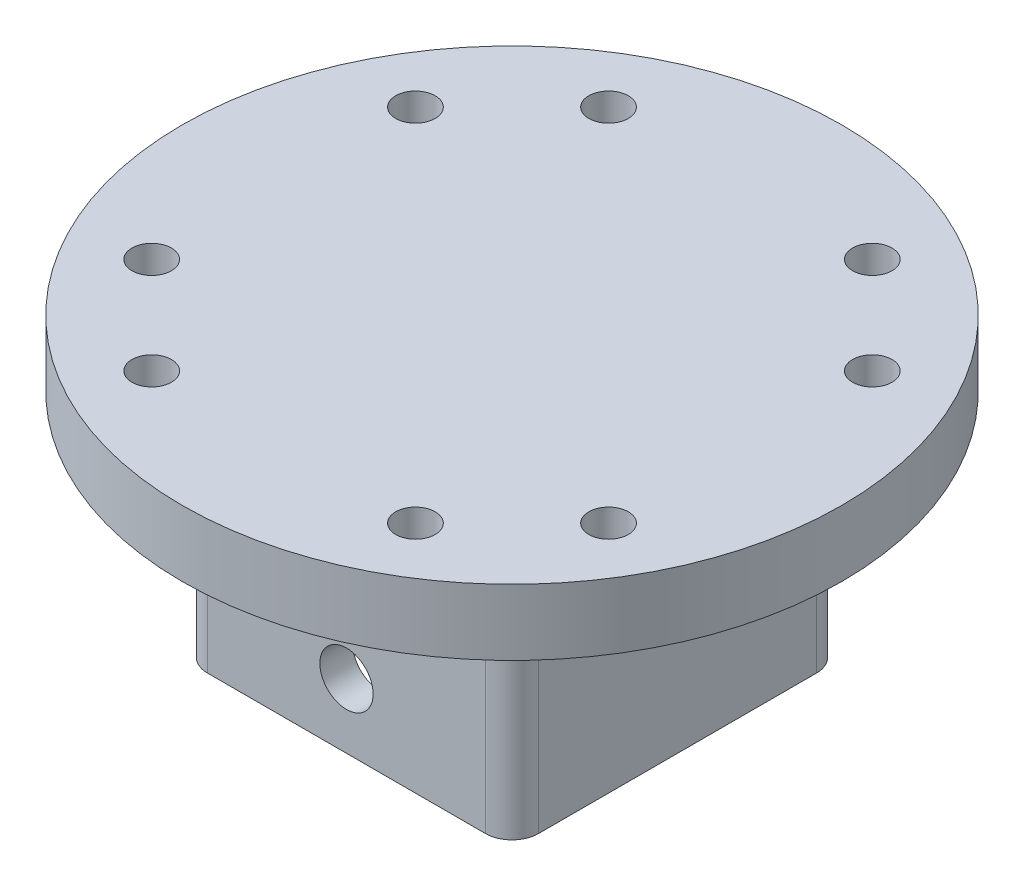
ISO-10303-21;
HEADER;
FILE_DESCRIPTION(('STEP AP214'),'2;1');
FILE_NAME('part.step','',(''),(''),'','','');
FILE_SCHEMA(('AUTOMOTIVE_DESIGN { 1 0 10303 214 1 1 1 1 }'));
ENDSEC;
DATA;
#1=APPLICATION_CONTEXT('core data for automotive mechanical design processes');
#2=APPLICATION_PROTOCOL_DEFINITION('international standard','automotive_design',2000,#1);
#3=PRODUCT_CONTEXT('',#1,'mechanical');
#4=PRODUCT('Part','Part','',(#3));
#5=PRODUCT_RELATED_PRODUCT_CATEGORY('part','',(#4));
#6=PRODUCT_DEFINITION_FORMATION('','',#4);
#7=PRODUCT_DEFINITION_CONTEXT('part definition',#1,'design');
#8=PRODUCT_DEFINITION('design','',#6,#7);
#9=PRODUCT_DEFINITION_SHAPE('','',#8);
#10=(LENGTH_UNIT() NAMED_UNIT(*) SI_UNIT(.MILLI.,.METRE.));
#11=(NAMED_UNIT(*) PLANE_ANGLE_UNIT() SI_UNIT($,.RADIAN.));
#12=(NAMED_UNIT(*) SI_UNIT($,.STERADIAN.) SOLID_ANGLE_UNIT());
#13=UNCERTAINTY_MEASURE_WITH_UNIT(LENGTH_MEASURE(1.E-05),#10,'distance_accuracy_value','');
#14=(GEOMETRIC_REPRESENTATION_CONTEXT(3) GLOBAL_UNCERTAINTY_ASSIGNED_CONTEXT((#13)) GLOBAL_UNIT_ASSIGNED_CONTEXT((#10,
#11,#12)) REPRESENTATION_CONTEXT('',''));
#15=CARTESIAN_POINT('',(0.,0.,0.));
#16=DIRECTION('',(0.,0.,1.));
#17=DIRECTION('',(1.,0.,0.));
#18=AXIS2_PLACEMENT_3D('',#15,#16,#17);
#19=CARTESIAN_POINT('',(0.,6.35,0.));
#20=DIRECTION('',(0.,-1.,0.));
#21=DIRECTION('',(0.,0.,-1.));
#22=AXIS2_PLACEMENT_3D('',#19,#20,#21);
#23=CYLINDRICAL_SURFACE('',#22,31.75);
#24=CARTESIAN_POINT('',(0.,6.35,0.));
#25=DIRECTION('',(0.,1.,0.));
#26=DIRECTION('',(0.,0.,1.));
#27=AXIS2_PLACEMENT_3D('',#24,#25,#26);
#28=CIRCLE('',#27,31.75);
#29=CARTESIAN_POINT('',(0.,6.35,31.75));
#30=VERTEX_POINT('',#29);
#31=EDGE_CURVE('E216',#30,#30,#28,.T.);
#32=ORIENTED_EDGE('',*,*,#31,.F.);
#33=EDGE_LOOP('',(#32));
#34=FACE_BOUND('',#33,.T.);
#35=CARTESIAN_POINT('',(0.,0.,0.));
#36=DIRECTION('',(0.,1.,0.));
#37=DIRECTION('',(0.,0.,1.));
#38=AXIS2_PLACEMENT_3D('',#35,#36,#37);
#39=CIRCLE('',#38,31.75);
#40=CARTESIAN_POINT('',(0.,0.,31.75));
#41=VERTEX_POINT('',#40);
#42=EDGE_CURVE('E215',#41,#41,#39,.T.);
#43=ORIENTED_EDGE('',*,*,#42,.T.);
#44=EDGE_LOOP('',(#43));
#45=FACE_BOUND('',#44,.T.);
#46=ADVANCED_FACE('F41',(#34,#45),#23,.T.);
#47=CARTESIAN_POINT('',(0.,6.35,0.));
#48=DIRECTION('',(0.,1.,0.));
#49=DIRECTION('',(0.,0.,1.));
#50=AXIS2_PLACEMENT_3D('',#47,#48,#49);
#51=PLANE('',#50);
#52=CARTESIAN_POINT('',(12.7000000000003,6.35,-21.9970452561246));
#53=DIRECTION('',(0.,1.,0.));
#54=DIRECTION('',(-1.,0.,0.));
#55=AXIS2_PLACEMENT_3D('',#52,#53,#54);
#56=CIRCLE('',#55,1.90000001);
#57=CARTESIAN_POINT('',(10.7999999900003,6.35,-21.9970452561246));
#58=VERTEX_POINT('',#57);
#59=EDGE_CURVE('E309',#58,#58,#56,.T.);
#60=ORIENTED_EDGE('',*,*,#59,.F.);
#61=EDGE_LOOP('',(#60));
#62=FACE_BOUND('',#61,.T.);
#63=CARTESIAN_POINT('',(-12.6999999999998,6.35,-21.9970452561249));
#64=DIRECTION('',(0.,1.,0.));
#65=DIRECTION('',(1.,0.,0.));
#66=AXIS2_PLACEMENT_3D('',#63,#64,#65);
#67=CIRCLE('',#66,1.90000001);
#68=CARTESIAN_POINT('',(-10.7999999899998,6.35,-21.9970452561248));
#69=VERTEX_POINT('',#68);
#70=EDGE_CURVE('E538',#69,#69,#67,.T.);
#71=ORIENTED_EDGE('',*,*,#70,.F.);
#72=EDGE_LOOP('',(#71));
#73=FACE_BOUND('',#72,.T.);
#74=CARTESIAN_POINT('',(-21.9970452561247,6.35,-12.7));
#75=DIRECTION('',(0.,1.,0.));
#76=DIRECTION('',(0.,0.,1.));
#77=AXIS2_PLACEMENT_3D('',#74,#75,#76);
#78=CIRCLE('',#77,1.90000001);
#79=CARTESIAN_POINT('',(-21.9970452561247,6.35,-10.79999999));
#80=VERTEX_POINT('',#79);
#81=EDGE_CURVE('E532',#80,#80,#78,.T.);
#82=ORIENTED_EDGE('',*,*,#81,.F.);
#83=EDGE_LOOP('',(#82));
#84=FACE_BOUND('',#83,.T.);
#85=CARTESIAN_POINT('',(-21.9970452561247,6.35,12.7));
#86=DIRECTION('',(0.,1.,0.));
#87=DIRECTION('',(0.,0.,-1.));
#88=AXIS2_PLACEMENT_3D('',#85,#86,#87);
#89=CIRCLE('',#88,1.90000001);
#90=CARTESIAN_POINT('',(-21.9970452561247,6.35,10.79999999));
#91=VERTEX_POINT('',#90);
#92=EDGE_CURVE('E523',#91,#91,#89,.T.);
#93=ORIENTED_EDGE('',*,*,#92,.F.);
#94=EDGE_LOOP('',(#93));
#95=FACE_BOUND('',#94,.T.);
#96=CARTESIAN_POINT('',(-12.7000000000001,6.35,21.9970452561247));
#97=DIRECTION('',(0.,1.,0.));
#98=DIRECTION('',(1.,0.,0.));
#99=AXIS2_PLACEMENT_3D('',#96,#97,#98);
#100=CIRCLE('',#99,1.90000001);
#101=CARTESIAN_POINT('',(-10.7999999900001,6.35,21.9970452561247));
#102=VERTEX_POINT('',#101);
#103=EDGE_CURVE('E323',#102,#102,#100,.T.);
#104=ORIENTED_EDGE('',*,*,#103,.F.);
#105=EDGE_LOOP('',(#104));
#106=FACE_BOUND('',#105,.T.);
#107=CARTESIAN_POINT('',(12.7,6.35,21.9970452561248));
#108=DIRECTION('',(0.,1.,0.));
#109=DIRECTION('',(-1.,0.,0.));
#110=AXIS2_PLACEMENT_3D('',#107,#108,#109);
#111=CIRCLE('',#110,1.90000001);
#112=CARTESIAN_POINT('',(10.79999999,6.35,21.9970452561248));
#113=VERTEX_POINT('',#112);
#114=EDGE_CURVE('E226',#113,#113,#111,.T.);
#115=ORIENTED_EDGE('',*,*,#114,.F.);
#116=EDGE_LOOP('',(#115));
#117=FACE_BOUND('',#116,.T.);
#118=CARTESIAN_POINT('',(21.9970452561247,6.35,-12.7));
#119=DIRECTION('',(0.,1.,0.));
#120=DIRECTION('',(0.,0.,1.));
#121=AXIS2_PLACEMENT_3D('',#118,#119,#120);
#122=CIRCLE('',#121,1.90000001);
#123=CARTESIAN_POINT('',(21.9970452561247,6.35,-10.79999999));
#124=VERTEX_POINT('',#123);
#125=EDGE_CURVE('E194',#124,#124,#122,.T.);
#126=ORIENTED_EDGE('',*,*,#125,.F.);
#127=EDGE_LOOP('',(#126));
#128=FACE_BOUND('',#127,.T.);
#129=CARTESIAN_POINT('',(21.9970452561247,6.35,12.7));
#130=DIRECTION('',(0.,1.,0.));
#131=DIRECTION('',(0.,0.,-1.));
#132=AXIS2_PLACEMENT_3D('',#129,#130,#131);
#133=CIRCLE('',#132,1.90000001);
#134=CARTESIAN_POINT('',(21.9970452561247,6.35,10.79999999));
#135=VERTEX_POINT('',#134);
#136=EDGE_CURVE('E187',#135,#135,#133,.T.);
#137=ORIENTED_EDGE('',*,*,#136,.F.);
#138=EDGE_LOOP('',(#137));
#139=FACE_BOUND('',#138,.T.);
#140=ORIENTED_EDGE('',*,*,#31,.T.);
#141=EDGE_LOOP('',(#140));
#142=FACE_BOUND('',#141,.T.);
#143=ADVANCED_FACE('F346',(#62,#73,#84,#95,#106,#117,#128,#139,#142),#51,.T.);
#144=CARTESIAN_POINT('',(0.,0.,0.));
#145=DIRECTION('',(0.,1.,0.));
#146=DIRECTION('',(0.,0.,1.));
#147=AXIS2_PLACEMENT_3D('',#144,#145,#146);
#148=PLANE('',#147);
#149=DIRECTION('',(0.,0.,-1.));
#150=VECTOR('',#149,1.);
#151=CARTESIAN_POINT('',(18.4785,0.,0.));
#152=LINE('',#151,#150);
#153=CARTESIAN_POINT('',(18.4785,0.,13.3985));
#154=VERTEX_POINT('',#153);
#155=CARTESIAN_POINT('',(18.4785,0.,-13.3985));
#156=VERTEX_POINT('',#155);
#157=EDGE_CURVE('E264',#154,#156,#152,.T.);
#158=ORIENTED_EDGE('',*,*,#157,.T.);
#159=CARTESIAN_POINT('',(13.3985,0.,-13.3985));
#160=DIRECTION('',(0.,1.,0.));
#161=DIRECTION('',(0.,0.,1.));
#162=AXIS2_PLACEMENT_3D('',#159,#160,#161);
#163=CIRCLE('',#162,5.08);
#164=CARTESIAN_POINT('',(13.3985,0.,-18.4785));
#165=VERTEX_POINT('',#164);
#166=EDGE_CURVE('E266',#156,#165,#163,.T.);
#167=ORIENTED_EDGE('',*,*,#166,.T.);
#168=DIRECTION('',(-1.,0.,0.));
#169=VECTOR('',#168,1.);
#170=CARTESIAN_POINT('',(0.,0.,-18.4785));
#171=LINE('',#170,#169);
#172=CARTESIAN_POINT('',(-13.3985,0.,-18.4785));
#173=VERTEX_POINT('',#172);
#174=EDGE_CURVE('E252',#165,#173,#171,.T.);
#175=ORIENTED_EDGE('',*,*,#174,.T.);
#176=CARTESIAN_POINT('',(-13.3985,0.,-13.3985));
#177=DIRECTION('',(0.,1.,0.));
#178=DIRECTION('',(0.,0.,1.));
#179=AXIS2_PLACEMENT_3D('',#176,#177,#178);
#180=CIRCLE('',#179,5.08);
#181=CARTESIAN_POINT('',(-18.4785,0.,-13.3985));
#182=VERTEX_POINT('',#181);
#183=EDGE_CURVE('E254',#173,#182,#180,.T.);
#184=ORIENTED_EDGE('',*,*,#183,.T.);
#185=DIRECTION('',(0.,0.,1.));
#186=VECTOR('',#185,1.);
#187=CARTESIAN_POINT('',(-18.4785,0.,0.));
#188=LINE('',#187,#186);
#189=CARTESIAN_POINT('',(-18.4785,0.,13.3985));
#190=VERTEX_POINT('',#189);
#191=EDGE_CURVE('E256',#182,#190,#188,.T.);
#192=ORIENTED_EDGE('',*,*,#191,.T.);
#193=CARTESIAN_POINT('',(-13.3985,0.,13.3985));
#194=DIRECTION('',(0.,1.,0.));
#195=DIRECTION('',(0.,0.,1.));
#196=AXIS2_PLACEMENT_3D('',#193,#194,#195);
#197=CIRCLE('',#196,5.08);
#198=CARTESIAN_POINT('',(-13.3985,0.,18.4785));
#199=VERTEX_POINT('',#198);
#200=EDGE_CURVE('E258',#190,#199,#197,.T.);
#201=ORIENTED_EDGE('',*,*,#200,.T.);
#202=DIRECTION('',(1.,0.,0.));
#203=VECTOR('',#202,1.);
#204=CARTESIAN_POINT('',(0.,0.,18.4785));
#205=LINE('',#204,#203);
#206=CARTESIAN_POINT('',(13.3985,0.,18.4785));
#207=VERTEX_POINT('',#206);
#208=EDGE_CURVE('E260',#199,#207,#205,.T.);
#209=ORIENTED_EDGE('',*,*,#208,.T.);
#210=CARTESIAN_POINT('',(13.3985,0.,13.3985));
#211=DIRECTION('',(0.,1.,0.));
#212=DIRECTION('',(0.,0.,1.));
#213=AXIS2_PLACEMENT_3D('',#210,#211,#212);
#214=CIRCLE('',#213,5.08);
#215=EDGE_CURVE('E262',#207,#154,#214,.T.);
#216=ORIENTED_EDGE('',*,*,#215,.T.);
#217=EDGE_LOOP('',(#158,#167,#175,#184,#192,#201,#209,#216));
#218=FACE_BOUND('',#217,.T.);
#219=CARTESIAN_POINT('',(12.7000000000003,0.,-21.9970452561246));
#220=DIRECTION('',(0.,1.,0.));
#221=DIRECTION('',(-1.,0.,0.));
#222=AXIS2_PLACEMENT_3D('',#219,#220,#221);
#223=CIRCLE('',#222,1.90000001);
#224=CARTESIAN_POINT('',(10.7999999900003,0.,-21.9970452561246));
#225=VERTEX_POINT('',#224);
#226=EDGE_CURVE('E303',#225,#225,#223,.T.);
#227=ORIENTED_EDGE('',*,*,#226,.T.);
#228=EDGE_LOOP('',(#227));
#229=FACE_BOUND('',#228,.T.);
#230=CARTESIAN_POINT('',(-12.6999999999998,0.,-21.9970452561249));
#231=DIRECTION('',(0.,1.,0.));
#232=DIRECTION('',(1.,0.,0.));
#233=AXIS2_PLACEMENT_3D('',#230,#231,#232);
#234=CIRCLE('',#233,1.90000001);
#235=CARTESIAN_POINT('',(-10.7999999899998,0.,-21.9970452561248));
#236=VERTEX_POINT('',#235);
#237=EDGE_CURVE('E314',#236,#236,#234,.T.);
#238=ORIENTED_EDGE('',*,*,#237,.T.);
#239=EDGE_LOOP('',(#238));
#240=FACE_BOUND('',#239,.T.);
#241=CARTESIAN_POINT('',(-21.9970452561247,0.,-12.7));
#242=DIRECTION('',(0.,1.,0.));
#243=DIRECTION('',(0.,0.,1.));
#244=AXIS2_PLACEMENT_3D('',#241,#242,#243);
#245=CIRCLE('',#244,1.90000001);
#246=CARTESIAN_POINT('',(-21.9970452561247,0.,-10.79999999));
#247=VERTEX_POINT('',#246);
#248=EDGE_CURVE('E535',#247,#247,#245,.T.);
#249=ORIENTED_EDGE('',*,*,#248,.T.);
#250=EDGE_LOOP('',(#249));
#251=FACE_BOUND('',#250,.T.);
#252=CARTESIAN_POINT('',(-21.9970452561247,0.,12.7));
#253=DIRECTION('',(0.,1.,0.));
#254=DIRECTION('',(0.,0.,-1.));
#255=AXIS2_PLACEMENT_3D('',#252,#253,#254);
#256=CIRCLE('',#255,1.90000001);
#257=CARTESIAN_POINT('',(-21.9970452561247,0.,10.79999999));
#258=VERTEX_POINT('',#257);
#259=EDGE_CURVE('E527',#258,#258,#256,.T.);
#260=ORIENTED_EDGE('',*,*,#259,.T.);
#261=EDGE_LOOP('',(#260));
#262=FACE_BOUND('',#261,.T.);
#263=CARTESIAN_POINT('',(-12.7000000000001,0.,21.9970452561247));
#264=DIRECTION('',(0.,1.,0.));
#265=DIRECTION('',(1.,0.,0.));
#266=AXIS2_PLACEMENT_3D('',#263,#264,#265);
#267=CIRCLE('',#266,1.90000001);
#268=CARTESIAN_POINT('',(-10.7999999900001,0.,21.9970452561247));
#269=VERTEX_POINT('',#268);
#270=EDGE_CURVE('E521',#269,#269,#267,.T.);
#271=ORIENTED_EDGE('',*,*,#270,.T.);
#272=EDGE_LOOP('',(#271));
#273=FACE_BOUND('',#272,.T.);
#274=CARTESIAN_POINT('',(12.7,0.,21.9970452561248));
#275=DIRECTION('',(0.,1.,0.));
#276=DIRECTION('',(-1.,0.,0.));
#277=AXIS2_PLACEMENT_3D('',#274,#275,#276);
#278=CIRCLE('',#277,1.90000001);
#279=CARTESIAN_POINT('',(10.79999999,0.,21.9970452561248));
#280=VERTEX_POINT('',#279);
#281=EDGE_CURVE('E320',#280,#280,#278,.T.);
#282=ORIENTED_EDGE('',*,*,#281,.T.);
#283=EDGE_LOOP('',(#282));
#284=FACE_BOUND('',#283,.T.);
#285=CARTESIAN_POINT('',(21.9970452561247,0.,-12.7));
#286=DIRECTION('',(0.,1.,0.));
#287=DIRECTION('',(0.,0.,1.));
#288=AXIS2_PLACEMENT_3D('',#285,#286,#287);
#289=CIRCLE('',#288,1.90000001);
#290=CARTESIAN_POINT('',(21.9970452561247,0.,-10.79999999));
#291=VERTEX_POINT('',#290);
#292=EDGE_CURVE('E334',#291,#291,#289,.T.);
#293=ORIENTED_EDGE('',*,*,#292,.T.);
#294=EDGE_LOOP('',(#293));
#295=FACE_BOUND('',#294,.T.);
#296=CARTESIAN_POINT('',(21.9970452561247,0.,12.7));
#297=DIRECTION('',(0.,1.,0.));
#298=DIRECTION('',(0.,0.,-1.));
#299=AXIS2_PLACEMENT_3D('',#296,#297,#298);
#300=CIRCLE('',#299,1.90000001);
#301=CARTESIAN_POINT('',(21.9970452561247,0.,10.79999999));
#302=VERTEX_POINT('',#301);
#303=EDGE_CURVE('E336',#302,#302,#300,.T.);
#304=ORIENTED_EDGE('',*,*,#303,.T.);
#305=EDGE_LOOP('',(#304));
#306=FACE_BOUND('',#305,.T.);
#307=ORIENTED_EDGE('',*,*,#42,.F.);
#308=EDGE_LOOP('',(#307));
#309=FACE_BOUND('',#308,.T.);
#310=ADVANCED_FACE('F349',(#218,#229,#240,#251,#262,#273,#284,#295,#306,#309),#148,.F.);
#311=CARTESIAN_POINT('',(-15.9385,-22.225,-15.9385));
#312=DIRECTION('',(0.,0.,-1.));
#313=DIRECTION('',(-1.,0.,0.));
#314=AXIS2_PLACEMENT_3D('',#311,#312,#313);
#315=PLANE('',#314);
#316=CARTESIAN_POINT('',(0.,-16.002,-15.9385));
#317=DIRECTION('',(0.,0.,-1.));
#318=DIRECTION('',(-1.,0.,0.));
#319=AXIS2_PLACEMENT_3D('',#316,#317,#318);
#320=CIRCLE('',#319,2.563499953);
#321=CARTESIAN_POINT('',(-2.563499953,-16.002,-15.9385));
#322=VERTEX_POINT('',#321);
#323=EDGE_CURVE('E329',#322,#322,#320,.T.);
#324=ORIENTED_EDGE('',*,*,#323,.F.);
#325=EDGE_LOOP('',(#324));
#326=FACE_BOUND('',#325,.T.);
#327=DIRECTION('',(0.,1.,0.));
#328=VECTOR('',#327,1.);
#329=CARTESIAN_POINT('',(-13.3985,-22.225,-15.9385));
#330=LINE('',#329,#328);
#331=CARTESIAN_POINT('',(-13.3985,-22.225,-15.9385));
#332=VERTEX_POINT('',#331);
#333=CARTESIAN_POINT('',(-13.3985,-2.54,-15.9385));
#334=VERTEX_POINT('',#333);
#335=EDGE_CURVE('E248',#332,#334,#330,.T.);
#336=ORIENTED_EDGE('',*,*,#335,.T.);
#337=DIRECTION('',(-1.,0.,0.));
#338=VECTOR('',#337,1.);
#339=CARTESIAN_POINT('',(-15.9385,-2.54,-15.9385));
#340=LINE('',#339,#338);
#341=CARTESIAN_POINT('',(13.3985,-2.54,-15.9385));
#342=VERTEX_POINT('',#341);
#343=EDGE_CURVE('E11',#334,#342,#340,.F.);
#344=ORIENTED_EDGE('',*,*,#343,.T.);
#345=DIRECTION('',(0.,1.,0.));
#346=VECTOR('',#345,1.);
#347=CARTESIAN_POINT('',(13.3985,-22.225,-15.9385));
#348=LINE('',#347,#346);
#349=CARTESIAN_POINT('',(13.3985,-22.225,-15.9385));
#350=VERTEX_POINT('',#349);
#351=EDGE_CURVE('E250',#342,#350,#348,.F.);
#352=ORIENTED_EDGE('',*,*,#351,.T.);
#353=DIRECTION('',(-1.,0.,0.));
#354=VECTOR('',#353,1.);
#355=CARTESIAN_POINT('',(-15.9385,-22.225,-15.9385));
#356=LINE('',#355,#354);
#357=EDGE_CURVE('E200',#350,#332,#356,.T.);
#358=ORIENTED_EDGE('',*,*,#357,.T.);
#359=EDGE_LOOP('',(#336,#344,#352,#358));
#360=FACE_BOUND('',#359,.T.);
#361=ADVANCED_FACE('F360',(#326,#360),#315,.T.);
#362=CARTESIAN_POINT('',(15.9385,-22.225,-15.9385));
#363=DIRECTION('',(1.,0.,0.));
#364=DIRECTION('',(0.,0.,-1.));
#365=AXIS2_PLACEMENT_3D('',#362,#363,#364);
#366=PLANE('',#365);
#367=DIRECTION('',(0.,1.,0.));
#368=VECTOR('',#367,1.);
#369=CARTESIAN_POINT('',(15.9385,-22.225,-13.3985));
#370=LINE('',#369,#368);
#371=CARTESIAN_POINT('',(15.9385,-22.225,-13.3985));
#372=VERTEX_POINT('',#371);
#373=CARTESIAN_POINT('',(15.9385,-2.54,-13.3985));
#374=VERTEX_POINT('',#373);
#375=EDGE_CURVE('E243',#372,#374,#370,.T.);
#376=ORIENTED_EDGE('',*,*,#375,.T.);
#377=DIRECTION('',(0.,0.,-1.));
#378=VECTOR('',#377,1.);
#379=CARTESIAN_POINT('',(15.9385,-2.54,-15.9385));
#380=LINE('',#379,#378);
#381=CARTESIAN_POINT('',(15.9385,-2.54,13.3985));
#382=VERTEX_POINT('',#381);
#383=EDGE_CURVE('E272',#374,#382,#380,.F.);
#384=ORIENTED_EDGE('',*,*,#383,.T.);
#385=DIRECTION('',(0.,1.,0.));
#386=VECTOR('',#385,1.);
#387=CARTESIAN_POINT('',(15.9385,-22.225,13.3985));
#388=LINE('',#387,#386);
#389=CARTESIAN_POINT('',(15.9385,-22.225,13.3985));
#390=VERTEX_POINT('',#389);
#391=EDGE_CURVE('E246',#382,#390,#388,.F.);
#392=ORIENTED_EDGE('',*,*,#391,.T.);
#393=DIRECTION('',(0.,0.,-1.));
#394=VECTOR('',#393,1.);
#395=CARTESIAN_POINT('',(15.9385,-22.225,-15.9385));
#396=LINE('',#395,#394);
#397=EDGE_CURVE('E212',#390,#372,#396,.T.);
#398=ORIENTED_EDGE('',*,*,#397,.T.);
#399=EDGE_LOOP('',(#376,#384,#392,#398));
#400=FACE_BOUND('',#399,.T.);
#401=ADVANCED_FACE('F366',(#400),#366,.T.);
#402=CARTESIAN_POINT('',(15.9385,-22.225,15.9385));
#403=DIRECTION('',(0.,0.,1.));
#404=DIRECTION('',(1.,0.,0.));
#405=AXIS2_PLACEMENT_3D('',#402,#403,#404);
#406=PLANE('',#405);
#407=CARTESIAN_POINT('',(0.,-16.002,15.9385));
#408=DIRECTION('',(0.,0.,1.));
#409=DIRECTION('',(1.,0.,0.));
#410=AXIS2_PLACEMENT_3D('',#407,#408,#409);
#411=CIRCLE('',#410,2.563499953);
#412=CARTESIAN_POINT('',(2.563499953,-16.002,15.9385));
#413=VERTEX_POINT('',#412);
#414=EDGE_CURVE('E326',#413,#413,#411,.T.);
#415=ORIENTED_EDGE('',*,*,#414,.F.);
#416=EDGE_LOOP('',(#415));
#417=FACE_BOUND('',#416,.T.);
#418=DIRECTION('',(0.,1.,0.));
#419=VECTOR('',#418,1.);
#420=CARTESIAN_POINT('',(13.3985,-22.225,15.9385));
#421=LINE('',#420,#419);
#422=CARTESIAN_POINT('',(13.3985,-22.225,15.9385));
#423=VERTEX_POINT('',#422);
#424=CARTESIAN_POINT('',(13.3985,-2.54,15.9385));
#425=VERTEX_POINT('',#424);
#426=EDGE_CURVE('E230',#423,#425,#421,.T.);
#427=ORIENTED_EDGE('',*,*,#426,.T.);
#428=DIRECTION('',(1.,0.,0.));
#429=VECTOR('',#428,1.);
#430=CARTESIAN_POINT('',(15.9385,-2.54,15.9385));
#431=LINE('',#430,#429);
#432=CARTESIAN_POINT('',(-13.3985,-2.54,15.9385));
#433=VERTEX_POINT('',#432);
#434=EDGE_CURVE('E276',#425,#433,#431,.F.);
#435=ORIENTED_EDGE('',*,*,#434,.T.);
#436=DIRECTION('',(0.,1.,0.));
#437=VECTOR('',#436,1.);
#438=CARTESIAN_POINT('',(-13.3985,-22.225,15.9385));
#439=LINE('',#438,#437);
#440=CARTESIAN_POINT('',(-13.3985,-22.225,15.9385));
#441=VERTEX_POINT('',#440);
#442=EDGE_CURVE('E233',#433,#441,#439,.F.);
#443=ORIENTED_EDGE('',*,*,#442,.T.);
#444=DIRECTION('',(1.,0.,0.));
#445=VECTOR('',#444,1.);
#446=CARTESIAN_POINT('',(15.9385,-22.225,15.9385));
#447=LINE('',#446,#445);
#448=EDGE_CURVE('E209',#441,#423,#447,.T.);
#449=ORIENTED_EDGE('',*,*,#448,.T.);
#450=EDGE_LOOP('',(#427,#435,#443,#449));
#451=FACE_BOUND('',#450,.T.);
#452=ADVANCED_FACE('F445',(#417,#451),#406,.T.);
#453=CARTESIAN_POINT('',(-15.9385,-22.225,15.9385));
#454=DIRECTION('',(-1.,0.,0.));
#455=DIRECTION('',(0.,0.,1.));
#456=AXIS2_PLACEMENT_3D('',#453,#454,#455);
#457=PLANE('',#456);
#458=DIRECTION('',(0.,1.,0.));
#459=VECTOR('',#458,1.);
#460=CARTESIAN_POINT('',(-15.9385,-22.225,13.3985));
#461=LINE('',#460,#459);
#462=CARTESIAN_POINT('',(-15.9385,-22.225,13.3985));
#463=VERTEX_POINT('',#462);
#464=CARTESIAN_POINT('',(-15.9385,-2.54,13.3985));
#465=VERTEX_POINT('',#464);
#466=EDGE_CURVE('E228',#463,#465,#461,.T.);
#467=ORIENTED_EDGE('',*,*,#466,.T.);
#468=DIRECTION('',(0.,0.,1.));
#469=VECTOR('',#468,1.);
#470=CARTESIAN_POINT('',(-15.9385,-2.54,15.9385));
#471=LINE('',#470,#469);
#472=CARTESIAN_POINT('',(-15.9385,-2.54,-13.3985));
#473=VERTEX_POINT('',#472);
#474=EDGE_CURVE('E65',#465,#473,#471,.F.);
#475=ORIENTED_EDGE('',*,*,#474,.T.);
#476=DIRECTION('',(0.,1.,0.));
#477=VECTOR('',#476,1.);
#478=CARTESIAN_POINT('',(-15.9385,-22.225,-13.3985));
#479=LINE('',#478,#477);
#480=CARTESIAN_POINT('',(-15.9385,-22.225,-13.3985));
#481=VERTEX_POINT('',#480);
#482=EDGE_CURVE('E219',#473,#481,#479,.F.);
#483=ORIENTED_EDGE('',*,*,#482,.T.);
#484=DIRECTION('',(0.,0.,1.));
#485=VECTOR('',#484,1.);
#486=CARTESIAN_POINT('',(-15.9385,-22.225,15.9385));
#487=LINE('',#486,#485);
#488=EDGE_CURVE('E206',#481,#463,#487,.T.);
#489=ORIENTED_EDGE('',*,*,#488,.T.);
#490=EDGE_LOOP('',(#467,#475,#483,#489));
#491=FACE_BOUND('',#490,.T.);
#492=ADVANCED_FACE('F451',(#491),#457,.T.);
#493=CARTESIAN_POINT('',(0.,-22.225,0.));
#494=DIRECTION('',(0.,-1.,0.));
#495=DIRECTION('',(0.,0.,-1.));
#496=AXIS2_PLACEMENT_3D('',#493,#494,#495);
#497=PLANE('',#496);
#498=DIRECTION('',(-1.,0.,0.));
#499=VECTOR('',#498,1.);
#500=CARTESIAN_POINT('',(-12.7635,-22.225,-12.7635));
#501=LINE('',#500,#499);
#502=CARTESIAN_POINT('',(12.7635,-22.225,-12.7635));
#503=VERTEX_POINT('',#502);
#504=CARTESIAN_POINT('',(-12.7635,-22.225,-12.7635));
#505=VERTEX_POINT('',#504);
#506=EDGE_CURVE('E160',#503,#505,#501,.T.);
#507=ORIENTED_EDGE('',*,*,#506,.T.);
#508=DIRECTION('',(0.,0.,1.));
#509=VECTOR('',#508,1.);
#510=CARTESIAN_POINT('',(-12.7635,-22.225,12.7635));
#511=LINE('',#510,#509);
#512=CARTESIAN_POINT('',(-12.7635,-22.225,12.7635));
#513=VERTEX_POINT('',#512);
#514=EDGE_CURVE('E172',#505,#513,#511,.T.);
#515=ORIENTED_EDGE('',*,*,#514,.T.);
#516=DIRECTION('',(1.,0.,0.));
#517=VECTOR('',#516,1.);
#518=CARTESIAN_POINT('',(12.7635,-22.225,12.7635));
#519=LINE('',#518,#517);
#520=CARTESIAN_POINT('',(12.7635,-22.225,12.7635));
#521=VERTEX_POINT('',#520);
#522=EDGE_CURVE('E176',#513,#521,#519,.T.);
#523=ORIENTED_EDGE('',*,*,#522,.T.);
#524=DIRECTION('',(0.,0.,-1.));
#525=VECTOR('',#524,1.);
#526=CARTESIAN_POINT('',(12.7635,-22.225,-12.7635));
#527=LINE('',#526,#525);
#528=EDGE_CURVE('E168',#521,#503,#527,.T.);
#529=ORIENTED_EDGE('',*,*,#528,.T.);
#530=EDGE_LOOP('',(#507,#515,#523,#529));
#531=FACE_BOUND('',#530,.T.);
#532=ORIENTED_EDGE('',*,*,#448,.F.);
#533=CARTESIAN_POINT('',(-13.3985,-22.225,13.3985));
#534=DIRECTION('',(0.,-1.,0.));
#535=DIRECTION('',(0.,0.,-1.));
#536=AXIS2_PLACEMENT_3D('',#533,#534,#535);
#537=CIRCLE('',#536,2.54);
#538=EDGE_CURVE('E241',#441,#463,#537,.T.);
#539=ORIENTED_EDGE('',*,*,#538,.T.);
#540=ORIENTED_EDGE('',*,*,#488,.F.);
#541=CARTESIAN_POINT('',(-13.3985,-22.225,-13.3985));
#542=DIRECTION('',(0.,-1.,0.));
#543=DIRECTION('',(0.,0.,-1.));
#544=AXIS2_PLACEMENT_3D('',#541,#542,#543);
#545=CIRCLE('',#544,2.54);
#546=EDGE_CURVE('E235',#481,#332,#545,.T.);
#547=ORIENTED_EDGE('',*,*,#546,.T.);
#548=ORIENTED_EDGE('',*,*,#357,.F.);
#549=CARTESIAN_POINT('',(13.3985,-22.225,-13.3985));
#550=DIRECTION('',(0.,-1.,0.));
#551=DIRECTION('',(0.,0.,-1.));
#552=AXIS2_PLACEMENT_3D('',#549,#550,#551);
#553=CIRCLE('',#552,2.54);
#554=EDGE_CURVE('E237',#350,#372,#553,.T.);
#555=ORIENTED_EDGE('',*,*,#554,.T.);
#556=ORIENTED_EDGE('',*,*,#397,.F.);
#557=CARTESIAN_POINT('',(13.3985,-22.225,13.3985));
#558=DIRECTION('',(0.,-1.,0.));
#559=DIRECTION('',(0.,0.,-1.));
#560=AXIS2_PLACEMENT_3D('',#557,#558,#559);
#561=CIRCLE('',#560,2.54);
#562=EDGE_CURVE('E239',#390,#423,#561,.T.);
#563=ORIENTED_EDGE('',*,*,#562,.T.);
#564=EDGE_LOOP('',(#532,#539,#540,#547,#548,#555,#556,#563));
#565=FACE_BOUND('',#564,.T.);
#566=ADVANCED_FACE('F178',(#531,#565),#497,.T.);
#567=CARTESIAN_POINT('',(-12.7635,-22.225,-12.7635));
#568=DIRECTION('',(0.,0.,-1.));
#569=DIRECTION('',(-1.,0.,0.));
#570=AXIS2_PLACEMENT_3D('',#567,#568,#569);
#571=PLANE('',#570);
#572=CARTESIAN_POINT('',(0.,-16.002,-12.7635));
#573=DIRECTION('',(0.,0.,-1.));
#574=DIRECTION('',(-1.,0.,0.));
#575=AXIS2_PLACEMENT_3D('',#572,#573,#574);
#576=CIRCLE('',#575,2.563499953);
#577=CARTESIAN_POINT('',(-2.563499953,-16.002,-12.7635));
#578=VERTEX_POINT('',#577);
#579=EDGE_CURVE('E225',#578,#578,#576,.T.);
#580=ORIENTED_EDGE('',*,*,#579,.T.);
#581=EDGE_LOOP('',(#580));
#582=FACE_BOUND('',#581,.T.);
#583=DIRECTION('',(-1.,0.,0.));
#584=VECTOR('',#583,1.);
#585=CARTESIAN_POINT('',(-12.7635,0.,-12.7635));
#586=LINE('',#585,#584);
#587=CARTESIAN_POINT('',(12.7635,0.,-12.7635));
#588=VERTEX_POINT('',#587);
#589=CARTESIAN_POINT('',(-12.7635,0.,-12.7635));
#590=VERTEX_POINT('',#589);
#591=EDGE_CURVE('E163',#588,#590,#586,.T.);
#592=ORIENTED_EDGE('',*,*,#591,.T.);
#593=DIRECTION('',(0.,1.,0.));
#594=VECTOR('',#593,1.);
#595=CARTESIAN_POINT('',(-12.7635,-22.225,-12.7635));
#596=LINE('',#595,#594);
#597=EDGE_CURVE('E156',#505,#590,#596,.T.);
#598=ORIENTED_EDGE('',*,*,#597,.F.);
#599=ORIENTED_EDGE('',*,*,#506,.F.);
#600=DIRECTION('',(0.,1.,0.));
#601=VECTOR('',#600,1.);
#602=CARTESIAN_POINT('',(12.7635,-22.225,-12.7635));
#603=LINE('',#602,#601);
#604=EDGE_CURVE('E198',#503,#588,#603,.T.);
#605=ORIENTED_EDGE('',*,*,#604,.T.);
#606=EDGE_LOOP('',(#592,#598,#599,#605));
#607=FACE_BOUND('',#606,.T.);
#608=ADVANCED_FACE('F158',(#582,#607),#571,.F.);
#609=CARTESIAN_POINT('',(12.7635,-22.225,-12.7635));
#610=DIRECTION('',(1.,0.,0.));
#611=DIRECTION('',(0.,0.,-1.));
#612=AXIS2_PLACEMENT_3D('',#609,#610,#611);
#613=PLANE('',#612);
#614=DIRECTION('',(0.,0.,-1.));
#615=VECTOR('',#614,1.);
#616=CARTESIAN_POINT('',(12.7635,0.,-12.7635));
#617=LINE('',#616,#615);
#618=CARTESIAN_POINT('',(12.7635,0.,12.7635));
#619=VERTEX_POINT('',#618);
#620=EDGE_CURVE('E181',#619,#588,#617,.T.);
#621=ORIENTED_EDGE('',*,*,#620,.T.);
#622=ORIENTED_EDGE('',*,*,#604,.F.);
#623=ORIENTED_EDGE('',*,*,#528,.F.);
#624=DIRECTION('',(0.,1.,0.));
#625=VECTOR('',#624,1.);
#626=CARTESIAN_POINT('',(12.7635,-22.225,12.7635));
#627=LINE('',#626,#625);
#628=EDGE_CURVE('E201',#521,#619,#627,.T.);
#629=ORIENTED_EDGE('',*,*,#628,.T.);
#630=EDGE_LOOP('',(#621,#622,#623,#629));
#631=FACE_BOUND('',#630,.T.);
#632=ADVANCED_FACE('F466',(#631),#613,.F.);
#633=CARTESIAN_POINT('',(12.7635,-22.225,12.7635));
#634=DIRECTION('',(0.,0.,1.));
#635=DIRECTION('',(1.,0.,0.));
#636=AXIS2_PLACEMENT_3D('',#633,#634,#635);
#637=PLANE('',#636);
#638=CARTESIAN_POINT('',(0.,-16.002,12.7635));
#639=DIRECTION('',(0.,0.,1.));
#640=DIRECTION('',(1.,0.,0.));
#641=AXIS2_PLACEMENT_3D('',#638,#639,#640);
#642=CIRCLE('',#641,2.563499953);
#643=CARTESIAN_POINT('',(2.563499953,-16.002,12.7635));
#644=VERTEX_POINT('',#643);
#645=EDGE_CURVE('E222',#644,#644,#642,.T.);
#646=ORIENTED_EDGE('',*,*,#645,.T.);
#647=EDGE_LOOP('',(#646));
#648=FACE_BOUND('',#647,.T.);
#649=DIRECTION('',(1.,0.,0.));
#650=VECTOR('',#649,1.);
#651=CARTESIAN_POINT('',(12.7635,0.,12.7635));
#652=LINE('',#651,#650);
#653=CARTESIAN_POINT('',(-12.7635,0.,12.7635));
#654=VERTEX_POINT('',#653);
#655=EDGE_CURVE('E184',#654,#619,#652,.T.);
#656=ORIENTED_EDGE('',*,*,#655,.T.);
#657=ORIENTED_EDGE('',*,*,#628,.F.);
#658=ORIENTED_EDGE('',*,*,#522,.F.);
#659=DIRECTION('',(0.,1.,0.));
#660=VECTOR('',#659,1.);
#661=CARTESIAN_POINT('',(-12.7635,-22.225,12.7635));
#662=LINE('',#661,#660);
#663=EDGE_CURVE('E167',#513,#654,#662,.T.);
#664=ORIENTED_EDGE('',*,*,#663,.T.);
#665=EDGE_LOOP('',(#656,#657,#658,#664));
#666=FACE_BOUND('',#665,.T.);
#667=ADVANCED_FACE('F471',(#648,#666),#637,.F.);
#668=CARTESIAN_POINT('',(-12.7635,-22.225,12.7635));
#669=DIRECTION('',(-1.,0.,0.));
#670=DIRECTION('',(0.,0.,1.));
#671=AXIS2_PLACEMENT_3D('',#668,#669,#670);
#672=PLANE('',#671);
#673=DIRECTION('',(0.,0.,1.));
#674=VECTOR('',#673,1.);
#675=CARTESIAN_POINT('',(-12.7635,0.,12.7635));
#676=LINE('',#675,#674);
#677=EDGE_CURVE('E193',#590,#654,#676,.T.);
#678=ORIENTED_EDGE('',*,*,#677,.T.);
#679=ORIENTED_EDGE('',*,*,#663,.F.);
#680=ORIENTED_EDGE('',*,*,#514,.F.);
#681=ORIENTED_EDGE('',*,*,#597,.T.);
#682=EDGE_LOOP('',(#678,#679,#680,#681));
#683=FACE_BOUND('',#682,.T.);
#684=ADVANCED_FACE('F173',(#683),#672,.F.);
#685=CARTESIAN_POINT('',(0.,0.,0.));
#686=DIRECTION('',(0.,-1.,0.));
#687=DIRECTION('',(0.,0.,-1.));
#688=AXIS2_PLACEMENT_3D('',#685,#686,#687);
#689=PLANE('',#688);
#690=ORIENTED_EDGE('',*,*,#591,.F.);
#691=ORIENTED_EDGE('',*,*,#620,.F.);
#692=ORIENTED_EDGE('',*,*,#655,.F.);
#693=ORIENTED_EDGE('',*,*,#677,.F.);
#694=EDGE_LOOP('',(#690,#691,#692,#693));
#695=FACE_BOUND('',#694,.T.);
#696=ADVANCED_FACE('F470',(#695),#689,.T.);
#697=CARTESIAN_POINT('',(21.9970452561247,6.35,12.7));
#698=DIRECTION('',(0.,-1.,0.));
#699=DIRECTION('',(0.,0.,-1.));
#700=AXIS2_PLACEMENT_3D('',#697,#698,#699);
#701=CYLINDRICAL_SURFACE('',#700,1.90000001);
#702=ORIENTED_EDGE('',*,*,#136,.T.);
#703=EDGE_LOOP('',(#702));
#704=FACE_BOUND('',#703,.T.);
#705=ORIENTED_EDGE('',*,*,#303,.F.);
#706=EDGE_LOOP('',(#705));
#707=FACE_BOUND('',#706,.T.);
#708=ADVANCED_FACE('F343',(#704,#707),#701,.F.);
#709=CARTESIAN_POINT('',(21.9970452561247,6.35,-12.7));
#710=DIRECTION('',(0.,-1.,0.));
#711=DIRECTION('',(0.,0.,-1.));
#712=AXIS2_PLACEMENT_3D('',#709,#710,#711);
#713=CYLINDRICAL_SURFACE('',#712,1.90000001);
#714=ORIENTED_EDGE('',*,*,#125,.T.);
#715=EDGE_LOOP('',(#714));
#716=FACE_BOUND('',#715,.T.);
#717=ORIENTED_EDGE('',*,*,#292,.F.);
#718=EDGE_LOOP('',(#717));
#719=FACE_BOUND('',#718,.T.);
#720=ADVANCED_FACE('F483',(#716,#719),#713,.F.);
#721=CARTESIAN_POINT('',(0.,-16.002,-31.75));
#722=DIRECTION('',(0.,0.,1.));
#723=DIRECTION('',(1.,0.,0.));
#724=AXIS2_PLACEMENT_3D('',#721,#722,#723);
#725=CYLINDRICAL_SURFACE('',#724,2.563499953);
#726=ORIENTED_EDGE('',*,*,#414,.T.);
#727=EDGE_LOOP('',(#726));
#728=FACE_BOUND('',#727,.T.);
#729=ORIENTED_EDGE('',*,*,#645,.F.);
#730=EDGE_LOOP('',(#729));
#731=FACE_BOUND('',#730,.T.);
#732=ADVANCED_FACE('F486',(#728,#731),#725,.F.);
#733=ORIENTED_EDGE('',*,*,#323,.T.);
#734=EDGE_LOOP('',(#733));
#735=FACE_BOUND('',#734,.T.);
#736=ORIENTED_EDGE('',*,*,#579,.F.);
#737=EDGE_LOOP('',(#736));
#738=FACE_BOUND('',#737,.T.);
#739=ADVANCED_FACE('F488',(#735,#738),#725,.F.);
#740=CARTESIAN_POINT('',(12.7,6.35,21.9970452561248));
#741=DIRECTION('',(0.,-1.,0.));
#742=DIRECTION('',(0.,0.,-1.));
#743=AXIS2_PLACEMENT_3D('',#740,#741,#742);
#744=CYLINDRICAL_SURFACE('',#743,1.90000001);
#745=ORIENTED_EDGE('',*,*,#114,.T.);
#746=EDGE_LOOP('',(#745));
#747=FACE_BOUND('',#746,.T.);
#748=ORIENTED_EDGE('',*,*,#281,.F.);
#749=EDGE_LOOP('',(#748));
#750=FACE_BOUND('',#749,.T.);
#751=ADVANCED_FACE('F491',(#747,#750),#744,.F.);
#752=CARTESIAN_POINT('',(-12.7000000000001,6.35,21.9970452561247));
#753=DIRECTION('',(0.,-1.,0.));
#754=DIRECTION('',(0.,0.,-1.));
#755=AXIS2_PLACEMENT_3D('',#752,#753,#754);
#756=CYLINDRICAL_SURFACE('',#755,1.90000001);
#757=ORIENTED_EDGE('',*,*,#103,.T.);
#758=EDGE_LOOP('',(#757));
#759=FACE_BOUND('',#758,.T.);
#760=ORIENTED_EDGE('',*,*,#270,.F.);
#761=EDGE_LOOP('',(#760));
#762=FACE_BOUND('',#761,.T.);
#763=ADVANCED_FACE('F495',(#759,#762),#756,.F.);
#764=CARTESIAN_POINT('',(-21.9970452561247,6.35,12.7));
#765=DIRECTION('',(0.,-1.,0.));
#766=DIRECTION('',(0.,0.,-1.));
#767=AXIS2_PLACEMENT_3D('',#764,#765,#766);
#768=CYLINDRICAL_SURFACE('',#767,1.90000001);
#769=ORIENTED_EDGE('',*,*,#92,.T.);
#770=EDGE_LOOP('',(#769));
#771=FACE_BOUND('',#770,.T.);
#772=ORIENTED_EDGE('',*,*,#259,.F.);
#773=EDGE_LOOP('',(#772));
#774=FACE_BOUND('',#773,.T.);
#775=ADVANCED_FACE('F507',(#771,#774),#768,.F.);
#776=CARTESIAN_POINT('',(-21.9970452561247,6.35,-12.7));
#777=DIRECTION('',(0.,-1.,0.));
#778=DIRECTION('',(0.,0.,-1.));
#779=AXIS2_PLACEMENT_3D('',#776,#777,#778);
#780=CYLINDRICAL_SURFACE('',#779,1.90000001);
#781=ORIENTED_EDGE('',*,*,#81,.T.);
#782=EDGE_LOOP('',(#781));
#783=FACE_BOUND('',#782,.T.);
#784=ORIENTED_EDGE('',*,*,#248,.F.);
#785=EDGE_LOOP('',(#784));
#786=FACE_BOUND('',#785,.T.);
#787=ADVANCED_FACE('F503',(#783,#786),#780,.F.);
#788=CARTESIAN_POINT('',(-12.6999999999998,6.35,-21.9970452561249));
#789=DIRECTION('',(0.,-1.,0.));
#790=DIRECTION('',(0.,0.,-1.));
#791=AXIS2_PLACEMENT_3D('',#788,#789,#790);
#792=CYLINDRICAL_SURFACE('',#791,1.90000001);
#793=ORIENTED_EDGE('',*,*,#70,.T.);
#794=EDGE_LOOP('',(#793));
#795=FACE_BOUND('',#794,.T.);
#796=ORIENTED_EDGE('',*,*,#237,.F.);
#797=EDGE_LOOP('',(#796));
#798=FACE_BOUND('',#797,.T.);
#799=ADVANCED_FACE('F499',(#795,#798),#792,.F.);
#800=CARTESIAN_POINT('',(12.7000000000003,6.35,-21.9970452561246));
#801=DIRECTION('',(0.,-1.,0.));
#802=DIRECTION('',(0.,0.,-1.));
#803=AXIS2_PLACEMENT_3D('',#800,#801,#802);
#804=CYLINDRICAL_SURFACE('',#803,1.90000001);
#805=ORIENTED_EDGE('',*,*,#59,.T.);
#806=EDGE_LOOP('',(#805));
#807=FACE_BOUND('',#806,.T.);
#808=ORIENTED_EDGE('',*,*,#226,.F.);
#809=EDGE_LOOP('',(#808));
#810=FACE_BOUND('',#809,.T.);
#811=ADVANCED_FACE('F374',(#807,#810),#804,.F.);
#812=CARTESIAN_POINT('',(-13.3985,-22.225,13.3985));
#813=DIRECTION('',(0.,1.,0.));
#814=DIRECTION('',(0.,0.,1.));
#815=AXIS2_PLACEMENT_3D('',#812,#813,#814);
#816=CYLINDRICAL_SURFACE('',#815,2.54);
#817=ORIENTED_EDGE('',*,*,#442,.F.);
#818=CARTESIAN_POINT('',(-13.3985,-2.54,13.3985));
#819=DIRECTION('',(0.,1.,0.));
#820=DIRECTION('',(0.,0.,1.));
#821=AXIS2_PLACEMENT_3D('',#818,#819,#820);
#822=CIRCLE('',#821,2.54);
#823=EDGE_CURVE('E278',#433,#465,#822,.F.);
#824=ORIENTED_EDGE('',*,*,#823,.T.);
#825=ORIENTED_EDGE('',*,*,#466,.F.);
#826=ORIENTED_EDGE('',*,*,#538,.F.);
#827=EDGE_LOOP('',(#817,#824,#825,#826));
#828=FACE_BOUND('',#827,.T.);
#829=ADVANCED_FACE('F370',(#828),#816,.T.);
#830=CARTESIAN_POINT('',(13.3985,-22.225,13.3985));
#831=DIRECTION('',(0.,1.,0.));
#832=DIRECTION('',(0.,0.,1.));
#833=AXIS2_PLACEMENT_3D('',#830,#831,#832);
#834=CYLINDRICAL_SURFACE('',#833,2.54);
#835=ORIENTED_EDGE('',*,*,#391,.F.);
#836=CARTESIAN_POINT('',(13.3985,-2.54,13.3985));
#837=DIRECTION('',(0.,1.,0.));
#838=DIRECTION('',(0.,0.,1.));
#839=AXIS2_PLACEMENT_3D('',#836,#837,#838);
#840=CIRCLE('',#839,2.54);
#841=EDGE_CURVE('E274',#382,#425,#840,.F.);
#842=ORIENTED_EDGE('',*,*,#841,.T.);
#843=ORIENTED_EDGE('',*,*,#426,.F.);
#844=ORIENTED_EDGE('',*,*,#562,.F.);
#845=EDGE_LOOP('',(#835,#842,#843,#844));
#846=FACE_BOUND('',#845,.T.);
#847=ADVANCED_FACE('F373',(#846),#834,.T.);
#848=CARTESIAN_POINT('',(13.3985,-22.225,-13.3985));
#849=DIRECTION('',(0.,1.,0.));
#850=DIRECTION('',(0.,0.,1.));
#851=AXIS2_PLACEMENT_3D('',#848,#849,#850);
#852=CYLINDRICAL_SURFACE('',#851,2.54);
#853=ORIENTED_EDGE('',*,*,#351,.F.);
#854=CARTESIAN_POINT('',(13.3985,-2.54,-13.3985));
#855=DIRECTION('',(0.,1.,0.));
#856=DIRECTION('',(0.,0.,1.));
#857=AXIS2_PLACEMENT_3D('',#854,#855,#856);
#858=CIRCLE('',#857,2.54);
#859=EDGE_CURVE('E269',#342,#374,#858,.F.);
#860=ORIENTED_EDGE('',*,*,#859,.T.);
#861=ORIENTED_EDGE('',*,*,#375,.F.);
#862=ORIENTED_EDGE('',*,*,#554,.F.);
#863=EDGE_LOOP('',(#853,#860,#861,#862));
#864=FACE_BOUND('',#863,.T.);
#865=ADVANCED_FACE('F378',(#864),#852,.T.);
#866=CARTESIAN_POINT('',(-13.3985,-22.225,-13.3985));
#867=DIRECTION('',(0.,1.,0.));
#868=DIRECTION('',(0.,0.,1.));
#869=AXIS2_PLACEMENT_3D('',#866,#867,#868);
#870=CYLINDRICAL_SURFACE('',#869,2.54);
#871=ORIENTED_EDGE('',*,*,#482,.F.);
#872=CARTESIAN_POINT('',(-13.3985,-2.54,-13.3985));
#873=DIRECTION('',(0.,1.,0.));
#874=DIRECTION('',(0.,0.,1.));
#875=AXIS2_PLACEMENT_3D('',#872,#873,#874);
#876=CIRCLE('',#875,2.54);
#877=EDGE_CURVE('E50',#473,#334,#876,.F.);
#878=ORIENTED_EDGE('',*,*,#877,.T.);
#879=ORIENTED_EDGE('',*,*,#335,.F.);
#880=ORIENTED_EDGE('',*,*,#546,.F.);
#881=EDGE_LOOP('',(#871,#878,#879,#880));
#882=FACE_BOUND('',#881,.T.);
#883=ADVANCED_FACE('F382',(#882),#870,.T.);
#884=CARTESIAN_POINT('',(-13.3985,-2.54,13.3985));
#885=DIRECTION('',(0.,1.,0.));
#886=DIRECTION('',(0.,0.,1.));
#887=AXIS2_PLACEMENT_3D('',#884,#885,#886);
#888=TOROIDAL_SURFACE('',#887,5.08,2.54);
#889=CARTESIAN_POINT('',(-18.4785,-2.54,13.3985));
#890=DIRECTION('',(0.,0.,1.));
#891=DIRECTION('',(1.,0.,0.));
#892=AXIS2_PLACEMENT_3D('',#889,#890,#891);
#893=CIRCLE('',#892,2.54);
#894=EDGE_CURVE('E297',#465,#190,#893,.T.);
#895=ORIENTED_EDGE('',*,*,#894,.F.);
#896=ORIENTED_EDGE('',*,*,#823,.F.);
#897=CARTESIAN_POINT('',(-13.3985,-2.54,18.4785));
#898=DIRECTION('',(-1.,0.,0.));
#899=DIRECTION('',(0.,0.,1.));
#900=AXIS2_PLACEMENT_3D('',#897,#898,#899);
#901=CIRCLE('',#900,2.54);
#902=EDGE_CURVE('E45',#199,#433,#901,.T.);
#903=ORIENTED_EDGE('',*,*,#902,.F.);
#904=ORIENTED_EDGE('',*,*,#200,.F.);
#905=EDGE_LOOP('',(#895,#896,#903,#904));
#906=FACE_BOUND('',#905,.T.);
#907=ADVANCED_FACE('F43',(#906),#888,.F.);
#908=CARTESIAN_POINT('',(0.,-2.54,18.4785));
#909=DIRECTION('',(1.,0.,0.));
#910=DIRECTION('',(0.,0.,-1.));
#911=AXIS2_PLACEMENT_3D('',#908,#909,#910);
#912=CYLINDRICAL_SURFACE('',#911,2.54);
#913=ORIENTED_EDGE('',*,*,#902,.T.);
#914=ORIENTED_EDGE('',*,*,#434,.F.);
#915=CARTESIAN_POINT('',(13.3985,-2.54,18.4785));
#916=DIRECTION('',(-1.,0.,0.));
#917=DIRECTION('',(0.,0.,1.));
#918=AXIS2_PLACEMENT_3D('',#915,#916,#917);
#919=CIRCLE('',#918,2.54);
#920=EDGE_CURVE('E295',#207,#425,#919,.T.);
#921=ORIENTED_EDGE('',*,*,#920,.F.);
#922=ORIENTED_EDGE('',*,*,#208,.F.);
#923=EDGE_LOOP('',(#913,#914,#921,#922));
#924=FACE_BOUND('',#923,.T.);
#925=ADVANCED_FACE('F408',(#924),#912,.F.);
#926=CARTESIAN_POINT('',(-18.4785,-2.54,0.));
#927=DIRECTION('',(0.,0.,1.));
#928=DIRECTION('',(1.,0.,0.));
#929=AXIS2_PLACEMENT_3D('',#926,#927,#928);
#930=CYLINDRICAL_SURFACE('',#929,2.54);
#931=ORIENTED_EDGE('',*,*,#894,.T.);
#932=ORIENTED_EDGE('',*,*,#191,.F.);
#933=CARTESIAN_POINT('',(-18.4785,-2.54,-13.3985));
#934=DIRECTION('',(0.,0.,1.));
#935=DIRECTION('',(1.,0.,0.));
#936=AXIS2_PLACEMENT_3D('',#933,#934,#935);
#937=CIRCLE('',#936,2.54);
#938=EDGE_CURVE('E292',#473,#182,#937,.T.);
#939=ORIENTED_EDGE('',*,*,#938,.F.);
#940=ORIENTED_EDGE('',*,*,#474,.F.);
#941=EDGE_LOOP('',(#931,#932,#939,#940));
#942=FACE_BOUND('',#941,.T.);
#943=ADVANCED_FACE('F405',(#942),#930,.F.);
#944=CARTESIAN_POINT('',(13.3985,-2.54,13.3985));
#945=DIRECTION('',(0.,1.,0.));
#946=DIRECTION('',(0.,0.,1.));
#947=AXIS2_PLACEMENT_3D('',#944,#945,#946);
#948=TOROIDAL_SURFACE('',#947,5.08,2.54);
#949=ORIENTED_EDGE('',*,*,#920,.T.);
#950=ORIENTED_EDGE('',*,*,#841,.F.);
#951=CARTESIAN_POINT('',(18.4785,-2.54,13.3985));
#952=DIRECTION('',(0.,0.,1.));
#953=DIRECTION('',(1.,0.,0.));
#954=AXIS2_PLACEMENT_3D('',#951,#952,#953);
#955=CIRCLE('',#954,2.54);
#956=EDGE_CURVE('E289',#154,#382,#955,.T.);
#957=ORIENTED_EDGE('',*,*,#956,.F.);
#958=ORIENTED_EDGE('',*,*,#215,.F.);
#959=EDGE_LOOP('',(#949,#950,#957,#958));
#960=FACE_BOUND('',#959,.T.);
#961=ADVANCED_FACE('F401',(#960),#948,.F.);
#962=CARTESIAN_POINT('',(-13.3985,-2.54,-13.3985));
#963=DIRECTION('',(0.,1.,0.));
#964=DIRECTION('',(0.,0.,1.));
#965=AXIS2_PLACEMENT_3D('',#962,#963,#964);
#966=TOROIDAL_SURFACE('',#965,5.08,2.54);
#967=ORIENTED_EDGE('',*,*,#938,.T.);
#968=ORIENTED_EDGE('',*,*,#183,.F.);
#969=CARTESIAN_POINT('',(-13.3985,-2.54,-18.4785));
#970=DIRECTION('',(-1.,0.,0.));
#971=DIRECTION('',(0.,0.,1.));
#972=AXIS2_PLACEMENT_3D('',#969,#970,#971);
#973=CIRCLE('',#972,2.54);
#974=EDGE_CURVE('E286',#334,#173,#973,.T.);
#975=ORIENTED_EDGE('',*,*,#974,.F.);
#976=ORIENTED_EDGE('',*,*,#877,.F.);
#977=EDGE_LOOP('',(#967,#968,#975,#976));
#978=FACE_BOUND('',#977,.T.);
#979=ADVANCED_FACE('F397',(#978),#966,.F.);
#980=CARTESIAN_POINT('',(18.4785,-2.54,0.));
#981=DIRECTION('',(0.,0.,-1.));
#982=DIRECTION('',(-1.,0.,0.));
#983=AXIS2_PLACEMENT_3D('',#980,#981,#982);
#984=CYLINDRICAL_SURFACE('',#983,2.54);
#985=ORIENTED_EDGE('',*,*,#956,.T.);
#986=ORIENTED_EDGE('',*,*,#383,.F.);
#987=CARTESIAN_POINT('',(18.4785,-2.54,-13.3985));
#988=DIRECTION('',(0.,0.,1.));
#989=DIRECTION('',(1.,0.,0.));
#990=AXIS2_PLACEMENT_3D('',#987,#988,#989);
#991=CIRCLE('',#990,2.54);
#992=EDGE_CURVE('E284',#156,#374,#991,.T.);
#993=ORIENTED_EDGE('',*,*,#992,.F.);
#994=ORIENTED_EDGE('',*,*,#157,.F.);
#995=EDGE_LOOP('',(#985,#986,#993,#994));
#996=FACE_BOUND('',#995,.T.);
#997=ADVANCED_FACE('F393',(#996),#984,.F.);
#998=CARTESIAN_POINT('',(0.,-2.54,-18.4785));
#999=DIRECTION('',(-1.,0.,0.));
#1000=DIRECTION('',(0.,0.,1.));
#1001=AXIS2_PLACEMENT_3D('',#998,#999,#1000);
#1002=CYLINDRICAL_SURFACE('',#1001,2.54);
#1003=ORIENTED_EDGE('',*,*,#974,.T.);
#1004=ORIENTED_EDGE('',*,*,#174,.F.);
#1005=CARTESIAN_POINT('',(13.3985,-2.54,-18.4785));
#1006=DIRECTION('',(-1.,0.,0.));
#1007=DIRECTION('',(0.,0.,1.));
#1008=AXIS2_PLACEMENT_3D('',#1005,#1006,#1007);
#1009=CIRCLE('',#1008,2.54);
#1010=EDGE_CURVE('E282',#342,#165,#1009,.T.);
#1011=ORIENTED_EDGE('',*,*,#1010,.F.);
#1012=ORIENTED_EDGE('',*,*,#343,.F.);
#1013=EDGE_LOOP('',(#1003,#1004,#1011,#1012));
#1014=FACE_BOUND('',#1013,.T.);
#1015=ADVANCED_FACE('F389',(#1014),#1002,.F.);
#1016=CARTESIAN_POINT('',(13.3985,-2.54,-13.3985));
#1017=DIRECTION('',(0.,1.,0.));
#1018=DIRECTION('',(0.,0.,1.));
#1019=AXIS2_PLACEMENT_3D('',#1016,#1017,#1018);
#1020=TOROIDAL_SURFACE('',#1019,5.08,2.54);
#1021=ORIENTED_EDGE('',*,*,#992,.T.);
#1022=ORIENTED_EDGE('',*,*,#859,.F.);
#1023=ORIENTED_EDGE('',*,*,#1010,.T.);
#1024=ORIENTED_EDGE('',*,*,#166,.F.);
#1025=EDGE_LOOP('',(#1021,#1022,#1023,#1024));
#1026=FACE_BOUND('',#1025,.T.);
#1027=ADVANCED_FACE('F386',(#1026),#1020,.F.);
#1028=CLOSED_SHELL('',(#46,#143,#310,#361,#401,#452,#492,#566,#608,#632,#667,#684,#696,#708,
#720,#732,#739,#751,#763,#775,#787,#799,#811,#829,#847,#865,#883,#907,#925,#943,#961,#979,#997,
#1015,#1027));
#1029=MANIFOLD_SOLID_BREP('B2',#1028);
#1030=ADVANCED_BREP_SHAPE_REPRESENTATION('',(#18,#1029),#14);
#1031=SHAPE_DEFINITION_REPRESENTATION(#9,#1030);
ENDSEC;
END-ISO-10303-21;
